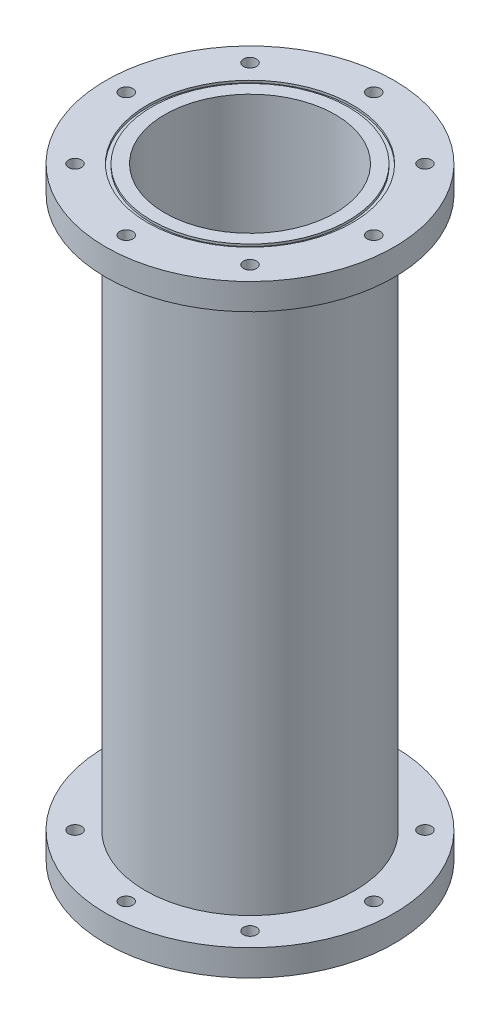
ISO-10303-21;
HEADER;
FILE_DESCRIPTION(('STEP AP214'),'2;1');
FILE_NAME('part.step','',(''),(''),'','','');
FILE_SCHEMA(('AUTOMOTIVE_DESIGN { 1 0 10303 214 1 1 1 1 }'));
ENDSEC;
DATA;
#1=APPLICATION_CONTEXT('core data for automotive mechanical design processes');
#2=APPLICATION_PROTOCOL_DEFINITION('international standard','automotive_design',2000,#1);
#3=PRODUCT_CONTEXT('',#1,'mechanical');
#4=PRODUCT('Part','Part','',(#3));
#5=PRODUCT_RELATED_PRODUCT_CATEGORY('part','',(#4));
#6=PRODUCT_DEFINITION_FORMATION('','',#4);
#7=PRODUCT_DEFINITION_CONTEXT('part definition',#1,'design');
#8=PRODUCT_DEFINITION('design','',#6,#7);
#9=PRODUCT_DEFINITION_SHAPE('','',#8);
#10=(LENGTH_UNIT() NAMED_UNIT(*) SI_UNIT(.MILLI.,.METRE.));
#11=(NAMED_UNIT(*) PLANE_ANGLE_UNIT() SI_UNIT($,.RADIAN.));
#12=(NAMED_UNIT(*) SI_UNIT($,.STERADIAN.) SOLID_ANGLE_UNIT());
#13=UNCERTAINTY_MEASURE_WITH_UNIT(LENGTH_MEASURE(1.E-05),#10,'distance_accuracy_value','');
#14=(GEOMETRIC_REPRESENTATION_CONTEXT(3) GLOBAL_UNCERTAINTY_ASSIGNED_CONTEXT((#13)) GLOBAL_UNIT_ASSIGNED_CONTEXT((#10,
#11,#12)) REPRESENTATION_CONTEXT('',''));
#15=CARTESIAN_POINT('',(0.,0.,0.));
#16=DIRECTION('',(0.,0.,1.));
#17=DIRECTION('',(1.,0.,0.));
#18=AXIS2_PLACEMENT_3D('',#15,#16,#17);
#19=CARTESIAN_POINT('',(0.,292.1,0.));
#20=DIRECTION('',(0.,1.,0.));
#21=DIRECTION('',(0.,0.,1.));
#22=AXIS2_PLACEMENT_3D('',#19,#20,#21);
#23=PLANE('',#22);
#24=CARTESIAN_POINT('',(0.,292.1,0.));
#25=DIRECTION('',(0.,1.,0.));
#26=DIRECTION('',(0.,0.,1.));
#27=AXIS2_PLACEMENT_3D('',#24,#25,#26);
#28=CIRCLE('',#27,41.275);
#29=CARTESIAN_POINT('',(0.,292.1,41.275));
#30=VERTEX_POINT('',#29);
#31=EDGE_CURVE('E46',#30,#30,#28,.T.);
#32=ORIENTED_EDGE('',*,*,#31,.F.);
#33=EDGE_LOOP('',(#32));
#34=FACE_BOUND('',#33,.T.);
#35=CARTESIAN_POINT('',(0.,292.1,0.));
#36=DIRECTION('',(0.,1.,0.));
#37=DIRECTION('',(0.,0.,1.));
#38=AXIS2_PLACEMENT_3D('',#35,#36,#37);
#39=CIRCLE('',#38,47.625);
#40=CARTESIAN_POINT('',(0.,292.1,47.625));
#41=VERTEX_POINT('',#40);
#42=EDGE_CURVE('E118',#41,#41,#39,.T.);
#43=ORIENTED_EDGE('',*,*,#42,.T.);
#44=EDGE_LOOP('',(#43));
#45=FACE_BOUND('',#44,.T.);
#46=ADVANCED_FACE('F33',(#34,#45),#23,.T.);
#47=CARTESIAN_POINT('',(0.,0.,0.));
#48=DIRECTION('',(0.,1.,0.));
#49=DIRECTION('',(0.,0.,1.));
#50=AXIS2_PLACEMENT_3D('',#47,#48,#49);
#51=PLANE('',#50);
#52=CARTESIAN_POINT('',(0.,0.,0.));
#53=DIRECTION('',(0.,1.,0.));
#54=DIRECTION('',(0.,0.,1.));
#55=AXIS2_PLACEMENT_3D('',#52,#53,#54);
#56=CIRCLE('',#55,41.275);
#57=CARTESIAN_POINT('',(0.,0.,41.275));
#58=VERTEX_POINT('',#57);
#59=EDGE_CURVE('E55',#58,#58,#56,.T.);
#60=ORIENTED_EDGE('',*,*,#59,.T.);
#61=EDGE_LOOP('',(#60));
#62=FACE_BOUND('',#61,.T.);
#63=CARTESIAN_POINT('',(0.,0.,0.));
#64=DIRECTION('',(0.,-1.,0.));
#65=DIRECTION('',(0.,0.,-1.));
#66=AXIS2_PLACEMENT_3D('',#63,#64,#65);
#67=CIRCLE('',#66,47.625);
#68=CARTESIAN_POINT('',(0.,0.,-47.625));
#69=VERTEX_POINT('',#68);
#70=EDGE_CURVE('E128',#69,#69,#67,.T.);
#71=ORIENTED_EDGE('',*,*,#70,.T.);
#72=EDGE_LOOP('',(#71));
#73=FACE_BOUND('',#72,.T.);
#74=ADVANCED_FACE('F166',(#62,#73),#51,.F.);
#75=CARTESIAN_POINT('',(0.,292.1,0.));
#76=DIRECTION('',(0.,-1.,0.));
#77=DIRECTION('',(0.,0.,-1.));
#78=AXIS2_PLACEMENT_3D('',#75,#76,#77);
#79=CYLINDRICAL_SURFACE('',#78,50.8);
#80=CARTESIAN_POINT('',(0.,12.7,0.));
#81=DIRECTION('',(0.,-1.,0.));
#82=DIRECTION('',(0.,0.,-1.));
#83=AXIS2_PLACEMENT_3D('',#80,#81,#82);
#84=CIRCLE('',#83,50.8);
#85=CARTESIAN_POINT('',(0.,12.7,-50.8));
#86=VERTEX_POINT('',#85);
#87=EDGE_CURVE('E41',#86,#86,#84,.T.);
#88=ORIENTED_EDGE('',*,*,#87,.F.);
#89=EDGE_LOOP('',(#88));
#90=FACE_BOUND('',#89,.T.);
#91=CARTESIAN_POINT('',(0.,279.4,0.));
#92=DIRECTION('',(0.,1.,0.));
#93=DIRECTION('',(0.,0.,1.));
#94=AXIS2_PLACEMENT_3D('',#91,#92,#93);
#95=CIRCLE('',#94,50.8);
#96=CARTESIAN_POINT('',(0.,279.4,50.8));
#97=VERTEX_POINT('',#96);
#98=EDGE_CURVE('E10',#97,#97,#95,.T.);
#99=ORIENTED_EDGE('',*,*,#98,.F.);
#100=EDGE_LOOP('',(#99));
#101=FACE_BOUND('',#100,.T.);
#102=ADVANCED_FACE('F35',(#90,#101),#79,.T.);
#103=CARTESIAN_POINT('',(-59.9186,292.1,0.));
#104=DIRECTION('',(0.,-1.,0.));
#105=DIRECTION('',(0.,0.,-1.));
#106=AXIS2_PLACEMENT_3D('',#103,#104,#105);
#107=CIRCLE('',#106,3.175);
#108=CARTESIAN_POINT('',(-59.9186,292.1,-3.175));
#109=VERTEX_POINT('',#108);
#110=EDGE_CURVE('E68',#109,#109,#107,.T.);
#111=ORIENTED_EDGE('',*,*,#110,.T.);
#112=EDGE_LOOP('',(#111));
#113=FACE_BOUND('',#112,.T.);
#114=CARTESIAN_POINT('',(-42.3688483792043,292.1,42.3688483792043));
#115=DIRECTION('',(0.,-1.,0.));
#116=DIRECTION('',(0.,0.,-1.));
#117=AXIS2_PLACEMENT_3D('',#114,#115,#116);
#118=CIRCLE('',#117,3.175);
#119=CARTESIAN_POINT('',(-42.3688483792043,292.1,39.1938483792043));
#120=VERTEX_POINT('',#119);
#121=EDGE_CURVE('E192',#120,#120,#118,.T.);
#122=ORIENTED_EDGE('',*,*,#121,.T.);
#123=EDGE_LOOP('',(#122));
#124=FACE_BOUND('',#123,.T.);
#125=CARTESIAN_POINT('',(0.,292.1,59.9186));
#126=DIRECTION('',(0.,-1.,0.));
#127=DIRECTION('',(0.,0.,-1.));
#128=AXIS2_PLACEMENT_3D('',#125,#126,#127);
#129=CIRCLE('',#128,3.175);
#130=CARTESIAN_POINT('',(0.,292.1,56.7436));
#131=VERTEX_POINT('',#130);
#132=EDGE_CURVE('E196',#131,#131,#129,.T.);
#133=ORIENTED_EDGE('',*,*,#132,.T.);
#134=EDGE_LOOP('',(#133));
#135=FACE_BOUND('',#134,.T.);
#136=CARTESIAN_POINT('',(42.3688483792043,292.1,42.3688483792043));
#137=DIRECTION('',(0.,-1.,0.));
#138=DIRECTION('',(0.,0.,-1.));
#139=AXIS2_PLACEMENT_3D('',#136,#137,#138);
#140=CIRCLE('',#139,3.175);
#141=CARTESIAN_POINT('',(42.3688483792043,292.1,39.1938483792043));
#142=VERTEX_POINT('',#141);
#143=EDGE_CURVE('E200',#142,#142,#140,.T.);
#144=ORIENTED_EDGE('',*,*,#143,.T.);
#145=EDGE_LOOP('',(#144));
#146=FACE_BOUND('',#145,.T.);
#147=CARTESIAN_POINT('',(59.9186,292.1,0.));
#148=DIRECTION('',(0.,-1.,0.));
#149=DIRECTION('',(0.,0.,-1.));
#150=AXIS2_PLACEMENT_3D('',#147,#148,#149);
#151=CIRCLE('',#150,3.17500000000001);
#152=CARTESIAN_POINT('',(59.9186,292.1,-3.175));
#153=VERTEX_POINT('',#152);
#154=EDGE_CURVE('E204',#153,#153,#151,.T.);
#155=ORIENTED_EDGE('',*,*,#154,.T.);
#156=EDGE_LOOP('',(#155));
#157=FACE_BOUND('',#156,.T.);
#158=CARTESIAN_POINT('',(42.3688483792043,292.1,-42.3688483792043));
#159=DIRECTION('',(0.,-1.,0.));
#160=DIRECTION('',(0.,0.,-1.));
#161=AXIS2_PLACEMENT_3D('',#158,#159,#160);
#162=CIRCLE('',#161,3.17500000000001);
#163=CARTESIAN_POINT('',(42.3688483792043,292.1,-45.5438483792043));
#164=VERTEX_POINT('',#163);
#165=EDGE_CURVE('E208',#164,#164,#162,.T.);
#166=ORIENTED_EDGE('',*,*,#165,.T.);
#167=EDGE_LOOP('',(#166));
#168=FACE_BOUND('',#167,.T.);
#169=CARTESIAN_POINT('',(0.,292.1,-59.9186));
#170=DIRECTION('',(0.,-1.,0.));
#171=DIRECTION('',(0.,0.,-1.));
#172=AXIS2_PLACEMENT_3D('',#169,#170,#171);
#173=CIRCLE('',#172,3.175);
#174=CARTESIAN_POINT('',(0.,292.1,-63.0936));
#175=VERTEX_POINT('',#174);
#176=EDGE_CURVE('E212',#175,#175,#173,.T.);
#177=ORIENTED_EDGE('',*,*,#176,.T.);
#178=EDGE_LOOP('',(#177));
#179=FACE_BOUND('',#178,.T.);
#180=CARTESIAN_POINT('',(-42.3688483792043,292.1,-42.3688483792043));
#181=DIRECTION('',(0.,-1.,0.));
#182=DIRECTION('',(0.,0.,-1.));
#183=AXIS2_PLACEMENT_3D('',#180,#181,#182);
#184=CIRCLE('',#183,3.17500000000001);
#185=CARTESIAN_POINT('',(-42.3688483792043,292.1,-45.5438483792043));
#186=VERTEX_POINT('',#185);
#187=EDGE_CURVE('E216',#186,#186,#184,.T.);
#188=ORIENTED_EDGE('',*,*,#187,.T.);
#189=EDGE_LOOP('',(#188));
#190=FACE_BOUND('',#189,.T.);
#191=CARTESIAN_POINT('',(0.,292.1,0.));
#192=DIRECTION('',(0.,1.,0.));
#193=DIRECTION('',(0.,0.,1.));
#194=AXIS2_PLACEMENT_3D('',#191,#192,#193);
#195=CIRCLE('',#194,49.53);
#196=CARTESIAN_POINT('',(0.,292.1,49.53));
#197=VERTEX_POINT('',#196);
#198=EDGE_CURVE('E122',#197,#197,#195,.T.);
#199=ORIENTED_EDGE('',*,*,#198,.F.);
#200=EDGE_LOOP('',(#199));
#201=FACE_BOUND('',#200,.T.);
#202=CARTESIAN_POINT('',(0.,292.1,0.));
#203=DIRECTION('',(0.,1.,0.));
#204=DIRECTION('',(0.,0.,1.));
#205=AXIS2_PLACEMENT_3D('',#202,#203,#204);
#206=CIRCLE('',#205,69.85);
#207=CARTESIAN_POINT('',(0.,292.1,69.85));
#208=VERTEX_POINT('',#207);
#209=EDGE_CURVE('E50',#208,#208,#206,.T.);
#210=ORIENTED_EDGE('',*,*,#209,.T.);
#211=EDGE_LOOP('',(#210));
#212=FACE_BOUND('',#211,.T.);
#213=ADVANCED_FACE('F147',(#113,#124,#135,#146,#157,#168,#179,#190,#201,#212),#23,.T.);
#214=CARTESIAN_POINT('',(-59.9186,0.,0.));
#215=DIRECTION('',(0.,1.,0.));
#216=DIRECTION('',(0.,0.,1.));
#217=AXIS2_PLACEMENT_3D('',#214,#215,#216);
#218=CIRCLE('',#217,3.175);
#219=CARTESIAN_POINT('',(-59.9186,0.,3.175));
#220=VERTEX_POINT('',#219);
#221=EDGE_CURVE('E115',#220,#220,#218,.T.);
#222=ORIENTED_EDGE('',*,*,#221,.T.);
#223=EDGE_LOOP('',(#222));
#224=FACE_BOUND('',#223,.T.);
#225=CARTESIAN_POINT('',(-42.3688483792043,0.,42.3688483792043));
#226=DIRECTION('',(0.,1.,0.));
#227=DIRECTION('',(0.,0.,1.));
#228=AXIS2_PLACEMENT_3D('',#225,#226,#227);
#229=CIRCLE('',#228,3.175);
#230=CARTESIAN_POINT('',(-42.3688483792043,0.,45.5438483792043));
#231=VERTEX_POINT('',#230);
#232=EDGE_CURVE('E100',#231,#231,#229,.T.);
#233=ORIENTED_EDGE('',*,*,#232,.T.);
#234=EDGE_LOOP('',(#233));
#235=FACE_BOUND('',#234,.T.);
#236=CARTESIAN_POINT('',(0.,0.,59.9186));
#237=DIRECTION('',(0.,1.,0.));
#238=DIRECTION('',(0.,0.,1.));
#239=AXIS2_PLACEMENT_3D('',#236,#237,#238);
#240=CIRCLE('',#239,3.175);
#241=CARTESIAN_POINT('',(0.,0.,63.0936));
#242=VERTEX_POINT('',#241);
#243=EDGE_CURVE('E96',#242,#242,#240,.T.);
#244=ORIENTED_EDGE('',*,*,#243,.T.);
#245=EDGE_LOOP('',(#244));
#246=FACE_BOUND('',#245,.T.);
#247=CARTESIAN_POINT('',(42.3688483792043,0.,42.3688483792043));
#248=DIRECTION('',(0.,1.,0.));
#249=DIRECTION('',(0.,0.,1.));
#250=AXIS2_PLACEMENT_3D('',#247,#248,#249);
#251=CIRCLE('',#250,3.175);
#252=CARTESIAN_POINT('',(42.3688483792043,0.,45.5438483792043));
#253=VERTEX_POINT('',#252);
#254=EDGE_CURVE('E92',#253,#253,#251,.T.);
#255=ORIENTED_EDGE('',*,*,#254,.T.);
#256=EDGE_LOOP('',(#255));
#257=FACE_BOUND('',#256,.T.);
#258=CARTESIAN_POINT('',(59.9186,0.,0.));
#259=DIRECTION('',(0.,1.,0.));
#260=DIRECTION('',(0.,0.,1.));
#261=AXIS2_PLACEMENT_3D('',#258,#259,#260);
#262=CIRCLE('',#261,3.17500000000001);
#263=CARTESIAN_POINT('',(59.9186,0.,3.17500000000001));
#264=VERTEX_POINT('',#263);
#265=EDGE_CURVE('E88',#264,#264,#262,.T.);
#266=ORIENTED_EDGE('',*,*,#265,.T.);
#267=EDGE_LOOP('',(#266));
#268=FACE_BOUND('',#267,.T.);
#269=CARTESIAN_POINT('',(42.3688483792043,0.,-42.3688483792043));
#270=DIRECTION('',(0.,1.,0.));
#271=DIRECTION('',(0.,0.,1.));
#272=AXIS2_PLACEMENT_3D('',#269,#270,#271);
#273=CIRCLE('',#272,3.17500000000001);
#274=CARTESIAN_POINT('',(42.3688483792043,0.,-39.1938483792043));
#275=VERTEX_POINT('',#274);
#276=EDGE_CURVE('E83',#275,#275,#273,.T.);
#277=ORIENTED_EDGE('',*,*,#276,.T.);
#278=EDGE_LOOP('',(#277));
#279=FACE_BOUND('',#278,.T.);
#280=CARTESIAN_POINT('',(0.,0.,-59.9186));
#281=DIRECTION('',(0.,1.,0.));
#282=DIRECTION('',(0.,0.,1.));
#283=AXIS2_PLACEMENT_3D('',#280,#281,#282);
#284=CIRCLE('',#283,3.175);
#285=CARTESIAN_POINT('',(0.,0.,-56.7436));
#286=VERTEX_POINT('',#285);
#287=EDGE_CURVE('E78',#286,#286,#284,.T.);
#288=ORIENTED_EDGE('',*,*,#287,.T.);
#289=EDGE_LOOP('',(#288));
#290=FACE_BOUND('',#289,.T.);
#291=CARTESIAN_POINT('',(-42.3688483792043,0.,-42.3688483792043));
#292=DIRECTION('',(0.,1.,0.));
#293=DIRECTION('',(0.,0.,1.));
#294=AXIS2_PLACEMENT_3D('',#291,#292,#293);
#295=CIRCLE('',#294,3.17500000000001);
#296=CARTESIAN_POINT('',(-42.3688483792043,0.,-39.1938483792043));
#297=VERTEX_POINT('',#296);
#298=EDGE_CURVE('E73',#297,#297,#295,.T.);
#299=ORIENTED_EDGE('',*,*,#298,.T.);
#300=EDGE_LOOP('',(#299));
#301=FACE_BOUND('',#300,.T.);
#302=CARTESIAN_POINT('',(0.,0.,0.));
#303=DIRECTION('',(0.,-1.,0.));
#304=DIRECTION('',(0.,0.,-1.));
#305=AXIS2_PLACEMENT_3D('',#302,#303,#304);
#306=CIRCLE('',#305,49.53);
#307=CARTESIAN_POINT('',(0.,0.,-49.53));
#308=VERTEX_POINT('',#307);
#309=EDGE_CURVE('E134',#308,#308,#306,.T.);
#310=ORIENTED_EDGE('',*,*,#309,.F.);
#311=EDGE_LOOP('',(#310));
#312=FACE_BOUND('',#311,.T.);
#313=CARTESIAN_POINT('',(0.,0.,0.));
#314=DIRECTION('',(0.,-1.,0.));
#315=DIRECTION('',(0.,0.,-1.));
#316=AXIS2_PLACEMENT_3D('',#313,#314,#315);
#317=CIRCLE('',#316,69.85);
#318=CARTESIAN_POINT('',(0.,0.,-69.85));
#319=VERTEX_POINT('',#318);
#320=EDGE_CURVE('E56',#319,#319,#317,.T.);
#321=ORIENTED_EDGE('',*,*,#320,.T.);
#322=EDGE_LOOP('',(#321));
#323=FACE_BOUND('',#322,.T.);
#324=ADVANCED_FACE('F173',(#224,#235,#246,#257,#268,#279,#290,#301,#312,#323),#51,.F.);
#325=CARTESIAN_POINT('',(0.,292.1,0.));
#326=DIRECTION('',(0.,-1.,0.));
#327=DIRECTION('',(0.,0.,-1.));
#328=AXIS2_PLACEMENT_3D('',#325,#326,#327);
#329=CYLINDRICAL_SURFACE('',#328,41.275);
#330=ORIENTED_EDGE('',*,*,#31,.T.);
#331=EDGE_LOOP('',(#330));
#332=FACE_BOUND('',#331,.T.);
#333=ORIENTED_EDGE('',*,*,#59,.F.);
#334=EDGE_LOOP('',(#333));
#335=FACE_BOUND('',#334,.T.);
#336=ADVANCED_FACE('F183',(#332,#335),#329,.F.);
#337=CARTESIAN_POINT('',(0.,12.7,0.));
#338=DIRECTION('',(0.,-1.,0.));
#339=DIRECTION('',(0.,0.,-1.));
#340=AXIS2_PLACEMENT_3D('',#337,#338,#339);
#341=PLANE('',#340);
#342=CARTESIAN_POINT('',(-59.9186,12.7,0.));
#343=DIRECTION('',(0.,-1.,0.));
#344=DIRECTION('',(0.,0.,-1.));
#345=AXIS2_PLACEMENT_3D('',#342,#343,#344);
#346=CIRCLE('',#345,3.175);
#347=CARTESIAN_POINT('',(-59.9186,12.7,-3.175));
#348=VERTEX_POINT('',#347);
#349=EDGE_CURVE('E112',#348,#348,#346,.T.);
#350=ORIENTED_EDGE('',*,*,#349,.T.);
#351=EDGE_LOOP('',(#350));
#352=FACE_BOUND('',#351,.T.);
#353=CARTESIAN_POINT('',(-42.3688483792043,12.7,42.3688483792043));
#354=DIRECTION('',(0.,-1.,0.));
#355=DIRECTION('',(0.,0.,-1.));
#356=AXIS2_PLACEMENT_3D('',#353,#354,#355);
#357=CIRCLE('',#356,3.175);
#358=CARTESIAN_POINT('',(-42.3688483792043,12.7,39.1938483792043));
#359=VERTEX_POINT('',#358);
#360=EDGE_CURVE('E95',#359,#359,#357,.T.);
#361=ORIENTED_EDGE('',*,*,#360,.T.);
#362=EDGE_LOOP('',(#361));
#363=FACE_BOUND('',#362,.T.);
#364=CARTESIAN_POINT('',(0.,12.7,59.9186));
#365=DIRECTION('',(0.,-1.,0.));
#366=DIRECTION('',(0.,0.,-1.));
#367=AXIS2_PLACEMENT_3D('',#364,#365,#366);
#368=CIRCLE('',#367,3.175);
#369=CARTESIAN_POINT('',(0.,12.7,56.7436));
#370=VERTEX_POINT('',#369);
#371=EDGE_CURVE('E91',#370,#370,#368,.T.);
#372=ORIENTED_EDGE('',*,*,#371,.T.);
#373=EDGE_LOOP('',(#372));
#374=FACE_BOUND('',#373,.T.);
#375=CARTESIAN_POINT('',(42.3688483792043,12.7,42.3688483792043));
#376=DIRECTION('',(0.,-1.,0.));
#377=DIRECTION('',(0.,0.,-1.));
#378=AXIS2_PLACEMENT_3D('',#375,#376,#377);
#379=CIRCLE('',#378,3.175);
#380=CARTESIAN_POINT('',(42.3688483792043,12.7,39.1938483792043));
#381=VERTEX_POINT('',#380);
#382=EDGE_CURVE('E87',#381,#381,#379,.T.);
#383=ORIENTED_EDGE('',*,*,#382,.T.);
#384=EDGE_LOOP('',(#383));
#385=FACE_BOUND('',#384,.T.);
#386=CARTESIAN_POINT('',(59.9186,12.7,0.));
#387=DIRECTION('',(0.,-1.,0.));
#388=DIRECTION('',(0.,0.,-1.));
#389=AXIS2_PLACEMENT_3D('',#386,#387,#388);
#390=CIRCLE('',#389,3.17500000000001);
#391=CARTESIAN_POINT('',(59.9186,12.7,-3.175));
#392=VERTEX_POINT('',#391);
#393=EDGE_CURVE('E82',#392,#392,#390,.T.);
#394=ORIENTED_EDGE('',*,*,#393,.T.);
#395=EDGE_LOOP('',(#394));
#396=FACE_BOUND('',#395,.T.);
#397=CARTESIAN_POINT('',(42.3688483792043,12.7,-42.3688483792043));
#398=DIRECTION('',(0.,-1.,0.));
#399=DIRECTION('',(0.,0.,-1.));
#400=AXIS2_PLACEMENT_3D('',#397,#398,#399);
#401=CIRCLE('',#400,3.17500000000001);
#402=CARTESIAN_POINT('',(42.3688483792043,12.7,-45.5438483792043));
#403=VERTEX_POINT('',#402);
#404=EDGE_CURVE('E77',#403,#403,#401,.T.);
#405=ORIENTED_EDGE('',*,*,#404,.T.);
#406=EDGE_LOOP('',(#405));
#407=FACE_BOUND('',#406,.T.);
#408=CARTESIAN_POINT('',(0.,12.7,-59.9186));
#409=DIRECTION('',(0.,-1.,0.));
#410=DIRECTION('',(0.,0.,-1.));
#411=AXIS2_PLACEMENT_3D('',#408,#409,#410);
#412=CIRCLE('',#411,3.175);
#413=CARTESIAN_POINT('',(0.,12.7,-63.0936));
#414=VERTEX_POINT('',#413);
#415=EDGE_CURVE('E72',#414,#414,#412,.T.);
#416=ORIENTED_EDGE('',*,*,#415,.T.);
#417=EDGE_LOOP('',(#416));
#418=FACE_BOUND('',#417,.T.);
#419=CARTESIAN_POINT('',(-42.3688483792043,12.7,-42.3688483792043));
#420=DIRECTION('',(0.,-1.,0.));
#421=DIRECTION('',(0.,0.,-1.));
#422=AXIS2_PLACEMENT_3D('',#419,#420,#421);
#423=CIRCLE('',#422,3.17500000000001);
#424=CARTESIAN_POINT('',(-42.3688483792043,12.7,-45.5438483792043));
#425=VERTEX_POINT('',#424);
#426=EDGE_CURVE('E67',#425,#425,#423,.T.);
#427=ORIENTED_EDGE('',*,*,#426,.T.);
#428=EDGE_LOOP('',(#427));
#429=FACE_BOUND('',#428,.T.);
#430=CARTESIAN_POINT('',(0.,12.7,0.));
#431=DIRECTION('',(0.,-1.,0.));
#432=DIRECTION('',(0.,0.,-1.));
#433=AXIS2_PLACEMENT_3D('',#430,#431,#432);
#434=CIRCLE('',#433,69.85);
#435=CARTESIAN_POINT('',(0.,12.7,-69.85));
#436=VERTEX_POINT('',#435);
#437=EDGE_CURVE('E52',#436,#436,#434,.T.);
#438=ORIENTED_EDGE('',*,*,#437,.F.);
#439=EDGE_LOOP('',(#438));
#440=FACE_BOUND('',#439,.T.);
#441=ORIENTED_EDGE('',*,*,#87,.T.);
#442=EDGE_LOOP('',(#441));
#443=FACE_BOUND('',#442,.T.);
#444=ADVANCED_FACE('F251',(#352,#363,#374,#385,#396,#407,#418,#429,#440,#443),#341,.F.);
#445=CARTESIAN_POINT('',(0.,12.7,0.));
#446=DIRECTION('',(0.,-1.,0.));
#447=DIRECTION('',(0.,0.,-1.));
#448=AXIS2_PLACEMENT_3D('',#445,#446,#447);
#449=CYLINDRICAL_SURFACE('',#448,69.85);
#450=ORIENTED_EDGE('',*,*,#437,.T.);
#451=EDGE_LOOP('',(#450));
#452=FACE_BOUND('',#451,.T.);
#453=ORIENTED_EDGE('',*,*,#320,.F.);
#454=EDGE_LOOP('',(#453));
#455=FACE_BOUND('',#454,.T.);
#456=ADVANCED_FACE('F161',(#452,#455),#449,.T.);
#457=CARTESIAN_POINT('',(0.,279.4,0.));
#458=DIRECTION('',(0.,1.,0.));
#459=DIRECTION('',(0.,0.,1.));
#460=AXIS2_PLACEMENT_3D('',#457,#458,#459);
#461=PLANE('',#460);
#462=CARTESIAN_POINT('',(-59.9186,279.4,0.));
#463=DIRECTION('',(0.,1.,0.));
#464=DIRECTION('',(0.,0.,1.));
#465=AXIS2_PLACEMENT_3D('',#462,#463,#464);
#466=CIRCLE('',#465,3.175);
#467=CARTESIAN_POINT('',(-59.9186,279.4,3.175));
#468=VERTEX_POINT('',#467);
#469=EDGE_CURVE('E37',#468,#468,#466,.T.);
#470=ORIENTED_EDGE('',*,*,#469,.T.);
#471=EDGE_LOOP('',(#470));
#472=FACE_BOUND('',#471,.T.);
#473=CARTESIAN_POINT('',(-42.3688483792043,279.4,42.3688483792043));
#474=DIRECTION('',(0.,1.,0.));
#475=DIRECTION('',(0.,0.,1.));
#476=AXIS2_PLACEMENT_3D('',#473,#474,#475);
#477=CIRCLE('',#476,3.175);
#478=CARTESIAN_POINT('',(-42.3688483792043,279.4,45.5438483792043));
#479=VERTEX_POINT('',#478);
#480=EDGE_CURVE('E93',#479,#479,#477,.T.);
#481=ORIENTED_EDGE('',*,*,#480,.T.);
#482=EDGE_LOOP('',(#481));
#483=FACE_BOUND('',#482,.T.);
#484=CARTESIAN_POINT('',(0.,279.4,59.9186));
#485=DIRECTION('',(0.,1.,0.));
#486=DIRECTION('',(0.,0.,1.));
#487=AXIS2_PLACEMENT_3D('',#484,#485,#486);
#488=CIRCLE('',#487,3.175);
#489=CARTESIAN_POINT('',(0.,279.4,63.0936));
#490=VERTEX_POINT('',#489);
#491=EDGE_CURVE('E89',#490,#490,#488,.T.);
#492=ORIENTED_EDGE('',*,*,#491,.T.);
#493=EDGE_LOOP('',(#492));
#494=FACE_BOUND('',#493,.T.);
#495=CARTESIAN_POINT('',(42.3688483792043,279.4,42.3688483792043));
#496=DIRECTION('',(0.,1.,0.));
#497=DIRECTION('',(0.,0.,1.));
#498=AXIS2_PLACEMENT_3D('',#495,#496,#497);
#499=CIRCLE('',#498,3.175);
#500=CARTESIAN_POINT('',(42.3688483792043,279.4,45.5438483792043));
#501=VERTEX_POINT('',#500);
#502=EDGE_CURVE('E84',#501,#501,#499,.T.);
#503=ORIENTED_EDGE('',*,*,#502,.T.);
#504=EDGE_LOOP('',(#503));
#505=FACE_BOUND('',#504,.T.);
#506=CARTESIAN_POINT('',(59.9186,279.4,0.));
#507=DIRECTION('',(0.,1.,0.));
#508=DIRECTION('',(0.,0.,1.));
#509=AXIS2_PLACEMENT_3D('',#506,#507,#508);
#510=CIRCLE('',#509,3.17500000000001);
#511=CARTESIAN_POINT('',(59.9186,279.4,3.17500000000001));
#512=VERTEX_POINT('',#511);
#513=EDGE_CURVE('E79',#512,#512,#510,.T.);
#514=ORIENTED_EDGE('',*,*,#513,.T.);
#515=EDGE_LOOP('',(#514));
#516=FACE_BOUND('',#515,.T.);
#517=CARTESIAN_POINT('',(42.3688483792043,279.4,-42.3688483792043));
#518=DIRECTION('',(0.,1.,0.));
#519=DIRECTION('',(0.,0.,1.));
#520=AXIS2_PLACEMENT_3D('',#517,#518,#519);
#521=CIRCLE('',#520,3.17500000000001);
#522=CARTESIAN_POINT('',(42.3688483792043,279.4,-39.1938483792043));
#523=VERTEX_POINT('',#522);
#524=EDGE_CURVE('E74',#523,#523,#521,.T.);
#525=ORIENTED_EDGE('',*,*,#524,.T.);
#526=EDGE_LOOP('',(#525));
#527=FACE_BOUND('',#526,.T.);
#528=CARTESIAN_POINT('',(0.,279.4,-59.9186));
#529=DIRECTION('',(0.,1.,0.));
#530=DIRECTION('',(0.,0.,1.));
#531=AXIS2_PLACEMENT_3D('',#528,#529,#530);
#532=CIRCLE('',#531,3.175);
#533=CARTESIAN_POINT('',(0.,279.4,-56.7436));
#534=VERTEX_POINT('',#533);
#535=EDGE_CURVE('E69',#534,#534,#532,.T.);
#536=ORIENTED_EDGE('',*,*,#535,.T.);
#537=EDGE_LOOP('',(#536));
#538=FACE_BOUND('',#537,.T.);
#539=CARTESIAN_POINT('',(-42.3688483792043,279.4,-42.3688483792043));
#540=DIRECTION('',(0.,1.,0.));
#541=DIRECTION('',(0.,0.,1.));
#542=AXIS2_PLACEMENT_3D('',#539,#540,#541);
#543=CIRCLE('',#542,3.17500000000001);
#544=CARTESIAN_POINT('',(-42.3688483792043,279.4,-39.1938483792043));
#545=VERTEX_POINT('',#544);
#546=EDGE_CURVE('E64',#545,#545,#543,.T.);
#547=ORIENTED_EDGE('',*,*,#546,.T.);
#548=EDGE_LOOP('',(#547));
#549=FACE_BOUND('',#548,.T.);
#550=CARTESIAN_POINT('',(0.,279.4,0.));
#551=DIRECTION('',(0.,1.,0.));
#552=DIRECTION('',(0.,0.,1.));
#553=AXIS2_PLACEMENT_3D('',#550,#551,#552);
#554=CIRCLE('',#553,69.85);
#555=CARTESIAN_POINT('',(0.,279.4,69.85));
#556=VERTEX_POINT('',#555);
#557=EDGE_CURVE('E58',#556,#556,#554,.T.);
#558=ORIENTED_EDGE('',*,*,#557,.F.);
#559=EDGE_LOOP('',(#558));
#560=FACE_BOUND('',#559,.T.);
#561=ORIENTED_EDGE('',*,*,#98,.T.);
#562=EDGE_LOOP('',(#561));
#563=FACE_BOUND('',#562,.T.);
#564=ADVANCED_FACE('F152',(#472,#483,#494,#505,#516,#527,#538,#549,#560,#563),#461,.F.);
#565=CARTESIAN_POINT('',(0.,279.4,0.));
#566=DIRECTION('',(0.,1.,0.));
#567=DIRECTION('',(0.,0.,1.));
#568=AXIS2_PLACEMENT_3D('',#565,#566,#567);
#569=CYLINDRICAL_SURFACE('',#568,69.85);
#570=ORIENTED_EDGE('',*,*,#557,.T.);
#571=EDGE_LOOP('',(#570));
#572=FACE_BOUND('',#571,.T.);
#573=ORIENTED_EDGE('',*,*,#209,.F.);
#574=EDGE_LOOP('',(#573));
#575=FACE_BOUND('',#574,.T.);
#576=ADVANCED_FACE('F149',(#572,#575),#569,.T.);
#577=CARTESIAN_POINT('',(0.,1.1176,0.));
#578=DIRECTION('',(0.,-1.,0.));
#579=DIRECTION('',(0.,0.,-1.));
#580=AXIS2_PLACEMENT_3D('',#577,#578,#579);
#581=CYLINDRICAL_SURFACE('',#580,49.53);
#582=CARTESIAN_POINT('',(0.,1.1176,0.));
#583=DIRECTION('',(0.,-1.,0.));
#584=DIRECTION('',(0.,0.,-1.));
#585=AXIS2_PLACEMENT_3D('',#582,#583,#584);
#586=CIRCLE('',#585,49.53);
#587=CARTESIAN_POINT('',(0.,1.1176,-49.53));
#588=VERTEX_POINT('',#587);
#589=EDGE_CURVE('E137',#588,#588,#586,.T.);
#590=ORIENTED_EDGE('',*,*,#589,.F.);
#591=EDGE_LOOP('',(#590));
#592=FACE_BOUND('',#591,.T.);
#593=ORIENTED_EDGE('',*,*,#309,.T.);
#594=EDGE_LOOP('',(#593));
#595=FACE_BOUND('',#594,.T.);
#596=ADVANCED_FACE('F151',(#592,#595),#581,.F.);
#597=CARTESIAN_POINT('',(0.,1.1176,0.));
#598=DIRECTION('',(0.,-1.,0.));
#599=DIRECTION('',(0.,0.,-1.));
#600=AXIS2_PLACEMENT_3D('',#597,#598,#599);
#601=PLANE('',#600);
#602=CARTESIAN_POINT('',(0.,1.1176,0.));
#603=DIRECTION('',(0.,-1.,0.));
#604=DIRECTION('',(0.,0.,-1.));
#605=AXIS2_PLACEMENT_3D('',#602,#603,#604);
#606=CIRCLE('',#605,47.625);
#607=CARTESIAN_POINT('',(0.,1.1176,-47.625));
#608=VERTEX_POINT('',#607);
#609=EDGE_CURVE('E131',#608,#608,#606,.T.);
#610=ORIENTED_EDGE('',*,*,#609,.F.);
#611=EDGE_LOOP('',(#610));
#612=FACE_BOUND('',#611,.T.);
#613=ORIENTED_EDGE('',*,*,#589,.T.);
#614=EDGE_LOOP('',(#613));
#615=FACE_BOUND('',#614,.T.);
#616=ADVANCED_FACE('F158',(#612,#615),#601,.T.);
#617=CARTESIAN_POINT('',(0.,1.1176,0.));
#618=DIRECTION('',(0.,-1.,0.));
#619=DIRECTION('',(0.,0.,-1.));
#620=AXIS2_PLACEMENT_3D('',#617,#618,#619);
#621=CYLINDRICAL_SURFACE('',#620,47.625);
#622=ORIENTED_EDGE('',*,*,#609,.T.);
#623=EDGE_LOOP('',(#622));
#624=FACE_BOUND('',#623,.T.);
#625=ORIENTED_EDGE('',*,*,#70,.F.);
#626=EDGE_LOOP('',(#625));
#627=FACE_BOUND('',#626,.T.);
#628=ADVANCED_FACE('F222',(#624,#627),#621,.T.);
#629=CARTESIAN_POINT('',(0.,290.9824,0.));
#630=DIRECTION('',(0.,1.,0.));
#631=DIRECTION('',(0.,0.,1.));
#632=AXIS2_PLACEMENT_3D('',#629,#630,#631);
#633=CYLINDRICAL_SURFACE('',#632,49.53);
#634=CARTESIAN_POINT('',(0.,290.9824,0.));
#635=DIRECTION('',(0.,1.,0.));
#636=DIRECTION('',(0.,0.,1.));
#637=AXIS2_PLACEMENT_3D('',#634,#635,#636);
#638=CIRCLE('',#637,49.53);
#639=CARTESIAN_POINT('',(0.,290.9824,49.53));
#640=VERTEX_POINT('',#639);
#641=EDGE_CURVE('E125',#640,#640,#638,.T.);
#642=ORIENTED_EDGE('',*,*,#641,.F.);
#643=EDGE_LOOP('',(#642));
#644=FACE_BOUND('',#643,.T.);
#645=ORIENTED_EDGE('',*,*,#198,.T.);
#646=EDGE_LOOP('',(#645));
#647=FACE_BOUND('',#646,.T.);
#648=ADVANCED_FACE('F219',(#644,#647),#633,.F.);
#649=CARTESIAN_POINT('',(0.,290.9824,0.));
#650=DIRECTION('',(0.,1.,0.));
#651=DIRECTION('',(0.,0.,1.));
#652=AXIS2_PLACEMENT_3D('',#649,#650,#651);
#653=PLANE('',#652);
#654=CARTESIAN_POINT('',(0.,290.9824,0.));
#655=DIRECTION('',(0.,1.,0.));
#656=DIRECTION('',(0.,0.,1.));
#657=AXIS2_PLACEMENT_3D('',#654,#655,#656);
#658=CIRCLE('',#657,47.625);
#659=CARTESIAN_POINT('',(0.,290.9824,47.625));
#660=VERTEX_POINT('',#659);
#661=EDGE_CURVE('E119',#660,#660,#658,.T.);
#662=ORIENTED_EDGE('',*,*,#661,.F.);
#663=EDGE_LOOP('',(#662));
#664=FACE_BOUND('',#663,.T.);
#665=ORIENTED_EDGE('',*,*,#641,.T.);
#666=EDGE_LOOP('',(#665));
#667=FACE_BOUND('',#666,.T.);
#668=ADVANCED_FACE('F221',(#664,#667),#653,.T.);
#669=CARTESIAN_POINT('',(0.,290.9824,0.));
#670=DIRECTION('',(0.,1.,0.));
#671=DIRECTION('',(0.,0.,1.));
#672=AXIS2_PLACEMENT_3D('',#669,#670,#671);
#673=CYLINDRICAL_SURFACE('',#672,47.625);
#674=ORIENTED_EDGE('',*,*,#661,.T.);
#675=EDGE_LOOP('',(#674));
#676=FACE_BOUND('',#675,.T.);
#677=ORIENTED_EDGE('',*,*,#42,.F.);
#678=EDGE_LOOP('',(#677));
#679=FACE_BOUND('',#678,.T.);
#680=ADVANCED_FACE('F229',(#676,#679),#673,.T.);
#681=CARTESIAN_POINT('',(-42.3688483792043,292.1,-42.3688483792043));
#682=DIRECTION('',(0.,-1.,0.));
#683=DIRECTION('',(0.,0.,-1.));
#684=AXIS2_PLACEMENT_3D('',#681,#682,#683);
#685=CYLINDRICAL_SURFACE('',#684,3.17500000000001);
#686=ORIENTED_EDGE('',*,*,#187,.F.);
#687=EDGE_LOOP('',(#686));
#688=FACE_BOUND('',#687,.T.);
#689=ORIENTED_EDGE('',*,*,#546,.F.);
#690=EDGE_LOOP('',(#689));
#691=FACE_BOUND('',#690,.T.);
#692=ADVANCED_FACE('F290',(#688,#691),#685,.F.);
#693=CARTESIAN_POINT('',(0.,292.1,-59.9186));
#694=DIRECTION('',(0.,-1.,0.));
#695=DIRECTION('',(0.,0.,-1.));
#696=AXIS2_PLACEMENT_3D('',#693,#694,#695);
#697=CYLINDRICAL_SURFACE('',#696,3.175);
#698=ORIENTED_EDGE('',*,*,#176,.F.);
#699=EDGE_LOOP('',(#698));
#700=FACE_BOUND('',#699,.T.);
#701=ORIENTED_EDGE('',*,*,#535,.F.);
#702=EDGE_LOOP('',(#701));
#703=FACE_BOUND('',#702,.T.);
#704=ADVANCED_FACE('F295',(#700,#703),#697,.F.);
#705=CARTESIAN_POINT('',(42.3688483792043,292.1,-42.3688483792043));
#706=DIRECTION('',(0.,-1.,0.));
#707=DIRECTION('',(0.,0.,-1.));
#708=AXIS2_PLACEMENT_3D('',#705,#706,#707);
#709=CYLINDRICAL_SURFACE('',#708,3.17500000000001);
#710=ORIENTED_EDGE('',*,*,#165,.F.);
#711=EDGE_LOOP('',(#710));
#712=FACE_BOUND('',#711,.T.);
#713=ORIENTED_EDGE('',*,*,#524,.F.);
#714=EDGE_LOOP('',(#713));
#715=FACE_BOUND('',#714,.T.);
#716=ADVANCED_FACE('F308',(#712,#715),#709,.F.);
#717=CARTESIAN_POINT('',(59.9186,292.1,0.));
#718=DIRECTION('',(0.,-1.,0.));
#719=DIRECTION('',(0.,0.,-1.));
#720=AXIS2_PLACEMENT_3D('',#717,#718,#719);
#721=CYLINDRICAL_SURFACE('',#720,3.17500000000001);
#722=ORIENTED_EDGE('',*,*,#154,.F.);
#723=EDGE_LOOP('',(#722));
#724=FACE_BOUND('',#723,.T.);
#725=ORIENTED_EDGE('',*,*,#513,.F.);
#726=EDGE_LOOP('',(#725));
#727=FACE_BOUND('',#726,.T.);
#728=ADVANCED_FACE('F319',(#724,#727),#721,.F.);
#729=CARTESIAN_POINT('',(42.3688483792043,292.1,42.3688483792043));
#730=DIRECTION('',(0.,-1.,0.));
#731=DIRECTION('',(0.,0.,-1.));
#732=AXIS2_PLACEMENT_3D('',#729,#730,#731);
#733=CYLINDRICAL_SURFACE('',#732,3.175);
#734=ORIENTED_EDGE('',*,*,#143,.F.);
#735=EDGE_LOOP('',(#734));
#736=FACE_BOUND('',#735,.T.);
#737=ORIENTED_EDGE('',*,*,#502,.F.);
#738=EDGE_LOOP('',(#737));
#739=FACE_BOUND('',#738,.T.);
#740=ADVANCED_FACE('F330',(#736,#739),#733,.F.);
#741=CARTESIAN_POINT('',(0.,292.1,59.9186));
#742=DIRECTION('',(0.,-1.,0.));
#743=DIRECTION('',(0.,0.,-1.));
#744=AXIS2_PLACEMENT_3D('',#741,#742,#743);
#745=CYLINDRICAL_SURFACE('',#744,3.175);
#746=ORIENTED_EDGE('',*,*,#132,.F.);
#747=EDGE_LOOP('',(#746));
#748=FACE_BOUND('',#747,.T.);
#749=ORIENTED_EDGE('',*,*,#491,.F.);
#750=EDGE_LOOP('',(#749));
#751=FACE_BOUND('',#750,.T.);
#752=ADVANCED_FACE('F341',(#748,#751),#745,.F.);
#753=CARTESIAN_POINT('',(-42.3688483792043,292.1,42.3688483792043));
#754=DIRECTION('',(0.,-1.,0.));
#755=DIRECTION('',(0.,0.,-1.));
#756=AXIS2_PLACEMENT_3D('',#753,#754,#755);
#757=CYLINDRICAL_SURFACE('',#756,3.175);
#758=ORIENTED_EDGE('',*,*,#121,.F.);
#759=EDGE_LOOP('',(#758));
#760=FACE_BOUND('',#759,.T.);
#761=ORIENTED_EDGE('',*,*,#480,.F.);
#762=EDGE_LOOP('',(#761));
#763=FACE_BOUND('',#762,.T.);
#764=ADVANCED_FACE('F352',(#760,#763),#757,.F.);
#765=CARTESIAN_POINT('',(-59.9186,292.1,0.));
#766=DIRECTION('',(0.,-1.,0.));
#767=DIRECTION('',(0.,0.,-1.));
#768=AXIS2_PLACEMENT_3D('',#765,#766,#767);
#769=CYLINDRICAL_SURFACE('',#768,3.175);
#770=ORIENTED_EDGE('',*,*,#110,.F.);
#771=EDGE_LOOP('',(#770));
#772=FACE_BOUND('',#771,.T.);
#773=ORIENTED_EDGE('',*,*,#469,.F.);
#774=EDGE_LOOP('',(#773));
#775=FACE_BOUND('',#774,.T.);
#776=ADVANCED_FACE('F363',(#772,#775),#769,.F.);
#777=ORIENTED_EDGE('',*,*,#426,.F.);
#778=EDGE_LOOP('',(#777));
#779=FACE_BOUND('',#778,.T.);
#780=ORIENTED_EDGE('',*,*,#298,.F.);
#781=EDGE_LOOP('',(#780));
#782=FACE_BOUND('',#781,.T.);
#783=ADVANCED_FACE('F298',(#779,#782),#685,.F.);
#784=ORIENTED_EDGE('',*,*,#415,.F.);
#785=EDGE_LOOP('',(#784));
#786=FACE_BOUND('',#785,.T.);
#787=ORIENTED_EDGE('',*,*,#287,.F.);
#788=EDGE_LOOP('',(#787));
#789=FACE_BOUND('',#788,.T.);
#790=ADVANCED_FACE('F311',(#786,#789),#697,.F.);
#791=ORIENTED_EDGE('',*,*,#404,.F.);
#792=EDGE_LOOP('',(#791));
#793=FACE_BOUND('',#792,.T.);
#794=ORIENTED_EDGE('',*,*,#276,.F.);
#795=EDGE_LOOP('',(#794));
#796=FACE_BOUND('',#795,.T.);
#797=ADVANCED_FACE('F322',(#793,#796),#709,.F.);
#798=ORIENTED_EDGE('',*,*,#393,.F.);
#799=EDGE_LOOP('',(#798));
#800=FACE_BOUND('',#799,.T.);
#801=ORIENTED_EDGE('',*,*,#265,.F.);
#802=EDGE_LOOP('',(#801));
#803=FACE_BOUND('',#802,.T.);
#804=ADVANCED_FACE('F333',(#800,#803),#721,.F.);
#805=ORIENTED_EDGE('',*,*,#382,.F.);
#806=EDGE_LOOP('',(#805));
#807=FACE_BOUND('',#806,.T.);
#808=ORIENTED_EDGE('',*,*,#254,.F.);
#809=EDGE_LOOP('',(#808));
#810=FACE_BOUND('',#809,.T.);
#811=ADVANCED_FACE('F344',(#807,#810),#733,.F.);
#812=ORIENTED_EDGE('',*,*,#371,.F.);
#813=EDGE_LOOP('',(#812));
#814=FACE_BOUND('',#813,.T.);
#815=ORIENTED_EDGE('',*,*,#243,.F.);
#816=EDGE_LOOP('',(#815));
#817=FACE_BOUND('',#816,.T.);
#818=ADVANCED_FACE('F355',(#814,#817),#745,.F.);
#819=ORIENTED_EDGE('',*,*,#360,.F.);
#820=EDGE_LOOP('',(#819));
#821=FACE_BOUND('',#820,.T.);
#822=ORIENTED_EDGE('',*,*,#232,.F.);
#823=EDGE_LOOP('',(#822));
#824=FACE_BOUND('',#823,.T.);
#825=ADVANCED_FACE('F366',(#821,#824),#757,.F.);
#826=ORIENTED_EDGE('',*,*,#349,.F.);
#827=EDGE_LOOP('',(#826));
#828=FACE_BOUND('',#827,.T.);
#829=ORIENTED_EDGE('',*,*,#221,.F.);
#830=EDGE_LOOP('',(#829));
#831=FACE_BOUND('',#830,.T.);
#832=ADVANCED_FACE('F376',(#828,#831),#769,.F.);
#833=CLOSED_SHELL('',(#46,#74,#102,#213,#324,#336,#444,#456,#564,#576,#596,#616,#628,#648,#668,
#680,#692,#704,#716,#728,#740,#752,#764,#776,#783,#790,#797,#804,#811,#818,#825,#832));
#834=MANIFOLD_SOLID_BREP('B2',#833);
#835=ADVANCED_BREP_SHAPE_REPRESENTATION('',(#18,#834),#14);
#836=SHAPE_DEFINITION_REPRESENTATION(#9,#835);
ENDSEC;
END-ISO-10303-21;
